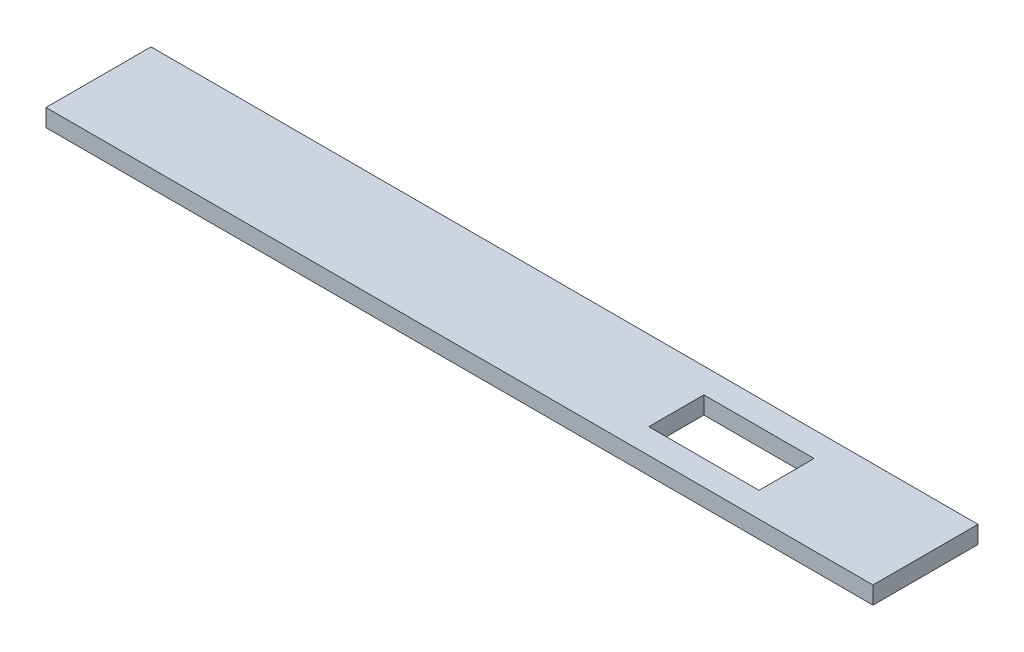
ISO-10303-21;
HEADER;
FILE_DESCRIPTION(('STEP AP214'),'2;1');
FILE_NAME('part.step','',(''),(''),'','','');
FILE_SCHEMA(('AUTOMOTIVE_DESIGN { 1 0 10303 214 1 1 1 1 }'));
ENDSEC;
DATA;
#1=APPLICATION_CONTEXT('core data for automotive mechanical design processes');
#2=APPLICATION_PROTOCOL_DEFINITION('international standard','automotive_design',2000,#1);
#3=PRODUCT_CONTEXT('',#1,'mechanical');
#4=PRODUCT('Part','Part','',(#3));
#5=PRODUCT_RELATED_PRODUCT_CATEGORY('part','',(#4));
#6=PRODUCT_DEFINITION_FORMATION('','',#4);
#7=PRODUCT_DEFINITION_CONTEXT('part definition',#1,'design');
#8=PRODUCT_DEFINITION('design','',#6,#7);
#9=PRODUCT_DEFINITION_SHAPE('','',#8);
#10=(LENGTH_UNIT() NAMED_UNIT(*) SI_UNIT(.MILLI.,.METRE.));
#11=(NAMED_UNIT(*) PLANE_ANGLE_UNIT() SI_UNIT($,.RADIAN.));
#12=(NAMED_UNIT(*) SI_UNIT($,.STERADIAN.) SOLID_ANGLE_UNIT());
#13=UNCERTAINTY_MEASURE_WITH_UNIT(LENGTH_MEASURE(1.E-05),#10,'distance_accuracy_value','');
#14=(GEOMETRIC_REPRESENTATION_CONTEXT(3) GLOBAL_UNCERTAINTY_ASSIGNED_CONTEXT((#13)) GLOBAL_UNIT_ASSIGNED_CONTEXT((#10,
#11,#12)) REPRESENTATION_CONTEXT('',''));
#15=CARTESIAN_POINT('',(0.,0.,0.));
#16=DIRECTION('',(0.,0.,1.));
#17=DIRECTION('',(1.,0.,0.));
#18=AXIS2_PLACEMENT_3D('',#15,#16,#17);
#19=CARTESIAN_POINT('',(395.443194984888,46.3300696869815,31.75));
#20=DIRECTION('',(-1.,0.,0.));
#21=DIRECTION('',(0.,0.,1.));
#22=AXIS2_PLACEMENT_3D('',#19,#20,#21);
#23=PLANE('',#22);
#24=DIRECTION('',(0.,1.,0.));
#25=VECTOR('',#24,1.);
#26=CARTESIAN_POINT('',(395.443194984888,46.3300696869815,-6.35));
#27=LINE('',#26,#25);
#28=CARTESIAN_POINT('',(395.443194984888,46.3300696869815,-6.35));
#29=VERTEX_POINT('',#28);
#30=CARTESIAN_POINT('',(395.443194984888,52.6800696869815,-6.35));
#31=VERTEX_POINT('',#30);
#32=EDGE_CURVE('E147',#29,#31,#27,.T.);
#33=ORIENTED_EDGE('',*,*,#32,.T.);
#34=DIRECTION('',(0.,0.,-1.));
#35=VECTOR('',#34,1.);
#36=CARTESIAN_POINT('',(395.443194984888,52.6800696869815,31.75));
#37=LINE('',#36,#35);
#38=CARTESIAN_POINT('',(395.443194984888,52.6800696869815,31.75));
#39=VERTEX_POINT('',#38);
#40=EDGE_CURVE('E11',#39,#31,#37,.T.);
#41=ORIENTED_EDGE('',*,*,#40,.F.);
#42=DIRECTION('',(0.,1.,0.));
#43=VECTOR('',#42,1.);
#44=CARTESIAN_POINT('',(395.443194984888,46.3300696869815,31.75));
#45=LINE('',#44,#43);
#46=CARTESIAN_POINT('',(395.443194984888,46.3300696869815,31.75));
#47=VERTEX_POINT('',#46);
#48=EDGE_CURVE('E153',#47,#39,#45,.T.);
#49=ORIENTED_EDGE('',*,*,#48,.F.);
#50=DIRECTION('',(0.,0.,-1.));
#51=VECTOR('',#50,1.);
#52=CARTESIAN_POINT('',(395.443194984888,46.3300696869815,31.75));
#53=LINE('',#52,#51);
#54=EDGE_CURVE('E167',#47,#29,#53,.T.);
#55=ORIENTED_EDGE('',*,*,#54,.T.);
#56=EDGE_LOOP('',(#33,#41,#49,#55));
#57=FACE_BOUND('',#56,.T.);
#58=ADVANCED_FACE('F39',(#57),#23,.F.);
#59=CARTESIAN_POINT('',(395.443194984888,52.6800696869815,31.75));
#60=DIRECTION('',(0.,-1.,0.));
#61=DIRECTION('',(1.,0.,0.));
#62=AXIS2_PLACEMENT_3D('',#59,#60,#61);
#63=PLANE('',#62);
#64=DIRECTION('',(1.,0.,0.));
#65=VECTOR('',#64,1.);
#66=CARTESIAN_POINT('',(305.026890103049,52.6800696869814,22.7));
#67=LINE('',#66,#65);
#68=CARTESIAN_POINT('',(305.026890103049,52.6800696869814,22.7));
#69=VERTEX_POINT('',#68);
#70=CARTESIAN_POINT('',(345.026890103049,52.6800696869815,22.7));
#71=VERTEX_POINT('',#70);
#72=EDGE_CURVE('E138',#69,#71,#67,.T.);
#73=ORIENTED_EDGE('',*,*,#72,.F.);
#74=DIRECTION('',(0.,0.,1.));
#75=VECTOR('',#74,1.);
#76=CARTESIAN_POINT('',(305.026890103049,52.6800696869814,2.7));
#77=LINE('',#76,#75);
#78=CARTESIAN_POINT('',(305.026890103049,52.6800696869814,2.7));
#79=VERTEX_POINT('',#78);
#80=EDGE_CURVE('E54',#79,#69,#77,.T.);
#81=ORIENTED_EDGE('',*,*,#80,.F.);
#82=DIRECTION('',(-1.,0.,0.));
#83=VECTOR('',#82,1.);
#84=CARTESIAN_POINT('',(305.026890103049,52.6800696869814,2.7));
#85=LINE('',#84,#83);
#86=CARTESIAN_POINT('',(345.026890103049,52.6800696869815,2.7));
#87=VERTEX_POINT('',#86);
#88=EDGE_CURVE('E125',#87,#79,#85,.T.);
#89=ORIENTED_EDGE('',*,*,#88,.F.);
#90=DIRECTION('',(0.,0.,-1.));
#91=VECTOR('',#90,1.);
#92=CARTESIAN_POINT('',(345.026890103049,52.6800696869815,2.7));
#93=LINE('',#92,#91);
#94=EDGE_CURVE('E129',#71,#87,#93,.T.);
#95=ORIENTED_EDGE('',*,*,#94,.F.);
#96=EDGE_LOOP('',(#73,#81,#89,#95));
#97=FACE_BOUND('',#96,.T.);
#98=DIRECTION('',(-1.,0.,0.));
#99=VECTOR('',#98,1.);
#100=CARTESIAN_POINT('',(395.443194984888,52.6800696869815,-6.35));
#101=LINE('',#100,#99);
#102=CARTESIAN_POINT('',(95.3421061472,52.6800696869814,-6.35));
#103=VERTEX_POINT('',#102);
#104=EDGE_CURVE('E171',#31,#103,#101,.T.);
#105=ORIENTED_EDGE('',*,*,#104,.T.);
#106=DIRECTION('',(0.,0.,-1.));
#107=VECTOR('',#106,1.);
#108=CARTESIAN_POINT('',(95.3421061472,52.6800696869814,31.75));
#109=LINE('',#108,#107);
#110=CARTESIAN_POINT('',(95.3421061472,52.6800696869814,31.75));
#111=VERTEX_POINT('',#110);
#112=EDGE_CURVE('E47',#111,#103,#109,.T.);
#113=ORIENTED_EDGE('',*,*,#112,.F.);
#114=DIRECTION('',(-1.,0.,0.));
#115=VECTOR('',#114,1.);
#116=CARTESIAN_POINT('',(395.443194984888,52.6800696869815,31.75));
#117=LINE('',#116,#115);
#118=EDGE_CURVE('E157',#39,#111,#117,.T.);
#119=ORIENTED_EDGE('',*,*,#118,.F.);
#120=ORIENTED_EDGE('',*,*,#40,.T.);
#121=EDGE_LOOP('',(#105,#113,#119,#120));
#122=FACE_BOUND('',#121,.T.);
#123=ADVANCED_FACE('F205',(#97,#122),#63,.F.);
#124=CARTESIAN_POINT('',(95.3421061472,46.3300696869815,31.75));
#125=DIRECTION('',(1.,0.,0.));
#126=DIRECTION('',(0.,0.,-1.));
#127=AXIS2_PLACEMENT_3D('',#124,#125,#126);
#128=PLANE('',#127);
#129=DIRECTION('',(0.,-1.,0.));
#130=VECTOR('',#129,1.);
#131=CARTESIAN_POINT('',(95.3421061472,46.3300696869815,-6.35));
#132=LINE('',#131,#130);
#133=CARTESIAN_POINT('',(95.3421061472,46.3300696869815,-6.35));
#134=VERTEX_POINT('',#133);
#135=EDGE_CURVE('E174',#103,#134,#132,.T.);
#136=ORIENTED_EDGE('',*,*,#135,.T.);
#137=DIRECTION('',(0.,0.,-1.));
#138=VECTOR('',#137,1.);
#139=CARTESIAN_POINT('',(95.3421061472,46.3300696869815,31.75));
#140=LINE('',#139,#138);
#141=CARTESIAN_POINT('',(95.3421061472,46.3300696869815,31.75));
#142=VERTEX_POINT('',#141);
#143=EDGE_CURVE('E182',#142,#134,#140,.T.);
#144=ORIENTED_EDGE('',*,*,#143,.F.);
#145=DIRECTION('',(0.,-1.,0.));
#146=VECTOR('',#145,1.);
#147=CARTESIAN_POINT('',(95.3421061472,46.3300696869815,31.75));
#148=LINE('',#147,#146);
#149=EDGE_CURVE('E161',#111,#142,#148,.T.);
#150=ORIENTED_EDGE('',*,*,#149,.F.);
#151=ORIENTED_EDGE('',*,*,#112,.T.);
#152=EDGE_LOOP('',(#136,#144,#150,#151));
#153=FACE_BOUND('',#152,.T.);
#154=ADVANCED_FACE('F191',(#153),#128,.F.);
#155=CARTESIAN_POINT('',(395.443194984888,46.3300696869815,31.75));
#156=DIRECTION('',(0.,1.,0.));
#157=DIRECTION('',(0.,0.,1.));
#158=AXIS2_PLACEMENT_3D('',#155,#156,#157);
#159=PLANE('',#158);
#160=DIRECTION('',(-1.,0.,0.));
#161=VECTOR('',#160,1.);
#162=CARTESIAN_POINT('',(305.026890103049,46.3300696869814,2.7));
#163=LINE('',#162,#161);
#164=CARTESIAN_POINT('',(345.026890103049,46.3300696869815,2.7));
#165=VERTEX_POINT('',#164);
#166=CARTESIAN_POINT('',(305.026890103049,46.3300696869814,2.7));
#167=VERTEX_POINT('',#166);
#168=EDGE_CURVE('E113',#165,#167,#163,.T.);
#169=ORIENTED_EDGE('',*,*,#168,.T.);
#170=DIRECTION('',(0.,0.,1.));
#171=VECTOR('',#170,1.);
#172=CARTESIAN_POINT('',(305.026890103049,46.3300696869814,2.7));
#173=LINE('',#172,#171);
#174=CARTESIAN_POINT('',(305.026890103049,46.3300696869814,22.7));
#175=VERTEX_POINT('',#174);
#176=EDGE_CURVE('E106',#167,#175,#173,.T.);
#177=ORIENTED_EDGE('',*,*,#176,.T.);
#178=DIRECTION('',(1.,0.,0.));
#179=VECTOR('',#178,1.);
#180=CARTESIAN_POINT('',(305.026890103049,46.3300696869814,22.7));
#181=LINE('',#180,#179);
#182=CARTESIAN_POINT('',(345.026890103049,46.3300696869815,22.7));
#183=VERTEX_POINT('',#182);
#184=EDGE_CURVE('E116',#175,#183,#181,.T.);
#185=ORIENTED_EDGE('',*,*,#184,.T.);
#186=DIRECTION('',(0.,0.,-1.));
#187=VECTOR('',#186,1.);
#188=CARTESIAN_POINT('',(345.026890103049,46.3300696869815,2.7));
#189=LINE('',#188,#187);
#190=EDGE_CURVE('E62',#183,#165,#189,.T.);
#191=ORIENTED_EDGE('',*,*,#190,.T.);
#192=EDGE_LOOP('',(#169,#177,#185,#191));
#193=FACE_BOUND('',#192,.T.);
#194=DIRECTION('',(1.,0.,0.));
#195=VECTOR('',#194,1.);
#196=CARTESIAN_POINT('',(395.443194984888,46.3300696869815,-6.35));
#197=LINE('',#196,#195);
#198=EDGE_CURVE('E158',#134,#29,#197,.T.);
#199=ORIENTED_EDGE('',*,*,#198,.T.);
#200=ORIENTED_EDGE('',*,*,#54,.F.);
#201=DIRECTION('',(1.,0.,0.));
#202=VECTOR('',#201,1.);
#203=CARTESIAN_POINT('',(395.443194984888,46.3300696869815,31.75));
#204=LINE('',#203,#202);
#205=EDGE_CURVE('E164',#142,#47,#204,.T.);
#206=ORIENTED_EDGE('',*,*,#205,.F.);
#207=ORIENTED_EDGE('',*,*,#143,.T.);
#208=EDGE_LOOP('',(#199,#200,#206,#207));
#209=FACE_BOUND('',#208,.T.);
#210=ADVANCED_FACE('F121',(#193,#209),#159,.F.);
#211=CARTESIAN_POINT('',(0.,0.,31.75));
#212=DIRECTION('',(0.,0.,1.));
#213=DIRECTION('',(1.,0.,0.));
#214=AXIS2_PLACEMENT_3D('',#211,#212,#213);
#215=PLANE('',#214);
#216=ORIENTED_EDGE('',*,*,#48,.T.);
#217=ORIENTED_EDGE('',*,*,#118,.T.);
#218=ORIENTED_EDGE('',*,*,#149,.T.);
#219=ORIENTED_EDGE('',*,*,#205,.T.);
#220=EDGE_LOOP('',(#216,#217,#218,#219));
#221=FACE_BOUND('',#220,.T.);
#222=ADVANCED_FACE('F204',(#221),#215,.T.);
#223=CARTESIAN_POINT('',(0.,0.,-6.35));
#224=DIRECTION('',(0.,0.,1.));
#225=DIRECTION('',(1.,0.,0.));
#226=AXIS2_PLACEMENT_3D('',#223,#224,#225);
#227=PLANE('',#226);
#228=ORIENTED_EDGE('',*,*,#32,.F.);
#229=ORIENTED_EDGE('',*,*,#198,.F.);
#230=ORIENTED_EDGE('',*,*,#135,.F.);
#231=ORIENTED_EDGE('',*,*,#104,.F.);
#232=EDGE_LOOP('',(#228,#229,#230,#231));
#233=FACE_BOUND('',#232,.T.);
#234=ADVANCED_FACE('F197',(#233),#227,.F.);
#235=CARTESIAN_POINT('',(305.026890103049,46.3300696869814,2.7));
#236=DIRECTION('',(-1.,0.,0.));
#237=DIRECTION('',(0.,-1.,0.));
#238=AXIS2_PLACEMENT_3D('',#235,#236,#237);
#239=PLANE('',#238);
#240=ORIENTED_EDGE('',*,*,#80,.T.);
#241=DIRECTION('',(0.,1.,0.));
#242=VECTOR('',#241,1.);
#243=CARTESIAN_POINT('',(305.026890103049,46.3300696869814,22.7));
#244=LINE('',#243,#242);
#245=EDGE_CURVE('E102',#175,#69,#244,.T.);
#246=ORIENTED_EDGE('',*,*,#245,.F.);
#247=ORIENTED_EDGE('',*,*,#176,.F.);
#248=DIRECTION('',(0.,1.,0.));
#249=VECTOR('',#248,1.);
#250=CARTESIAN_POINT('',(305.026890103049,46.3300696869814,2.7));
#251=LINE('',#250,#249);
#252=EDGE_CURVE('E144',#167,#79,#251,.T.);
#253=ORIENTED_EDGE('',*,*,#252,.T.);
#254=EDGE_LOOP('',(#240,#246,#247,#253));
#255=FACE_BOUND('',#254,.T.);
#256=ADVANCED_FACE('F104',(#255),#239,.F.);
#257=CARTESIAN_POINT('',(305.026890103049,46.3300696869814,2.7));
#258=DIRECTION('',(0.,0.,-1.));
#259=DIRECTION('',(-1.,0.,0.));
#260=AXIS2_PLACEMENT_3D('',#257,#258,#259);
#261=PLANE('',#260);
#262=ORIENTED_EDGE('',*,*,#88,.T.);
#263=ORIENTED_EDGE('',*,*,#252,.F.);
#264=ORIENTED_EDGE('',*,*,#168,.F.);
#265=DIRECTION('',(0.,1.,0.));
#266=VECTOR('',#265,1.);
#267=CARTESIAN_POINT('',(345.026890103049,46.3300696869815,2.7));
#268=LINE('',#267,#266);
#269=EDGE_CURVE('E148',#165,#87,#268,.T.);
#270=ORIENTED_EDGE('',*,*,#269,.T.);
#271=EDGE_LOOP('',(#262,#263,#264,#270));
#272=FACE_BOUND('',#271,.T.);
#273=ADVANCED_FACE('F222',(#272),#261,.F.);
#274=CARTESIAN_POINT('',(345.026890103049,46.3300696869815,2.7));
#275=DIRECTION('',(1.,0.,0.));
#276=DIRECTION('',(0.,1.,0.));
#277=AXIS2_PLACEMENT_3D('',#274,#275,#276);
#278=PLANE('',#277);
#279=ORIENTED_EDGE('',*,*,#94,.T.);
#280=ORIENTED_EDGE('',*,*,#269,.F.);
#281=ORIENTED_EDGE('',*,*,#190,.F.);
#282=DIRECTION('',(0.,1.,0.));
#283=VECTOR('',#282,1.);
#284=CARTESIAN_POINT('',(345.026890103049,46.3300696869815,22.7));
#285=LINE('',#284,#283);
#286=EDGE_CURVE('E112',#183,#71,#285,.T.);
#287=ORIENTED_EDGE('',*,*,#286,.T.);
#288=EDGE_LOOP('',(#279,#280,#281,#287));
#289=FACE_BOUND('',#288,.T.);
#290=ADVANCED_FACE('F225',(#289),#278,.F.);
#291=CARTESIAN_POINT('',(305.026890103049,46.3300696869814,22.7));
#292=DIRECTION('',(0.,0.,1.));
#293=DIRECTION('',(1.,0.,0.));
#294=AXIS2_PLACEMENT_3D('',#291,#292,#293);
#295=PLANE('',#294);
#296=ORIENTED_EDGE('',*,*,#72,.T.);
#297=ORIENTED_EDGE('',*,*,#286,.F.);
#298=ORIENTED_EDGE('',*,*,#184,.F.);
#299=ORIENTED_EDGE('',*,*,#245,.T.);
#300=EDGE_LOOP('',(#296,#297,#298,#299));
#301=FACE_BOUND('',#300,.T.);
#302=ADVANCED_FACE('F117',(#301),#295,.F.);
#303=CLOSED_SHELL('',(#58,#123,#154,#210,#222,#234,#256,#273,#290,#302));
#304=MANIFOLD_SOLID_BREP('B2',#303);
#305=ADVANCED_BREP_SHAPE_REPRESENTATION('',(#18,#304),#14);
#306=SHAPE_DEFINITION_REPRESENTATION(#9,#305);
ENDSEC;
END-ISO-10303-21;
